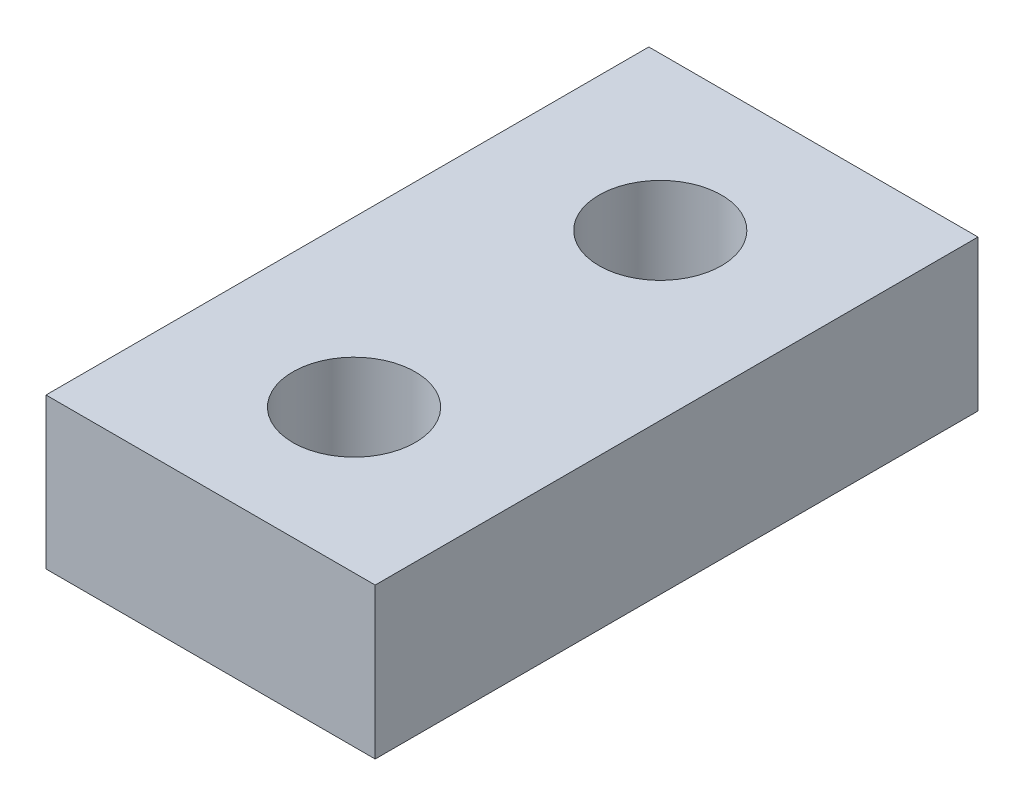
ISO-10303-21;
HEADER;
FILE_DESCRIPTION(('STEP AP214'),'2;1');
FILE_NAME('part.step','',(''),(''),'','','');
FILE_SCHEMA(('AUTOMOTIVE_DESIGN { 1 0 10303 214 1 1 1 1 }'));
ENDSEC;
DATA;
#1=APPLICATION_CONTEXT('core data for automotive mechanical design processes');
#2=APPLICATION_PROTOCOL_DEFINITION('international standard','automotive_design',2000,#1);
#3=PRODUCT_CONTEXT('',#1,'mechanical');
#4=PRODUCT('Part','Part','',(#3));
#5=PRODUCT_RELATED_PRODUCT_CATEGORY('part','',(#4));
#6=PRODUCT_DEFINITION_FORMATION('','',#4);
#7=PRODUCT_DEFINITION_CONTEXT('part definition',#1,'design');
#8=PRODUCT_DEFINITION('design','',#6,#7);
#9=PRODUCT_DEFINITION_SHAPE('','',#8);
#10=(LENGTH_UNIT() NAMED_UNIT(*) SI_UNIT(.MILLI.,.METRE.));
#11=(NAMED_UNIT(*) PLANE_ANGLE_UNIT() SI_UNIT($,.RADIAN.));
#12=(NAMED_UNIT(*) SI_UNIT($,.STERADIAN.) SOLID_ANGLE_UNIT());
#13=UNCERTAINTY_MEASURE_WITH_UNIT(LENGTH_MEASURE(1.E-05),#10,'distance_accuracy_value','');
#14=(GEOMETRIC_REPRESENTATION_CONTEXT(3) GLOBAL_UNCERTAINTY_ASSIGNED_CONTEXT((#13)) GLOBAL_UNIT_ASSIGNED_CONTEXT((#10,
#11,#12)) REPRESENTATION_CONTEXT('',''));
#15=CARTESIAN_POINT('',(0.,0.,0.));
#16=DIRECTION('',(0.,0.,1.));
#17=DIRECTION('',(1.,0.,0.));
#18=AXIS2_PLACEMENT_3D('',#15,#16,#17);
#19=CARTESIAN_POINT('',(0.,5.,0.));
#20=DIRECTION('',(0.,-1.,0.));
#21=DIRECTION('',(0.,0.,-1.));
#22=AXIS2_PLACEMENT_3D('',#19,#20,#21);
#23=PLANE('',#22);
#24=DIRECTION('',(0.,0.,1.));
#25=VECTOR('',#24,1.);
#26=CARTESIAN_POINT('',(0.,5.,0.));
#27=LINE('',#26,#25);
#28=CARTESIAN_POINT('',(0.,5.,-20.));
#29=VERTEX_POINT('',#28);
#30=CARTESIAN_POINT('',(0.,5.,0.));
#31=VERTEX_POINT('',#30);
#32=EDGE_CURVE('E85',#29,#31,#27,.T.);
#33=ORIENTED_EDGE('',*,*,#32,.T.);
#34=DIRECTION('',(1.,0.,0.));
#35=VECTOR('',#34,1.);
#36=CARTESIAN_POINT('',(0.,5.,0.));
#37=LINE('',#36,#35);
#38=CARTESIAN_POINT('',(10.922,5.,0.));
#39=VERTEX_POINT('',#38);
#40=EDGE_CURVE('E80',#31,#39,#37,.T.);
#41=ORIENTED_EDGE('',*,*,#40,.T.);
#42=DIRECTION('',(0.,0.,-1.));
#43=VECTOR('',#42,1.);
#44=CARTESIAN_POINT('',(10.922,5.,0.));
#45=LINE('',#44,#43);
#46=CARTESIAN_POINT('',(10.922,5.,-20.));
#47=VERTEX_POINT('',#46);
#48=EDGE_CURVE('E83',#39,#47,#45,.T.);
#49=ORIENTED_EDGE('',*,*,#48,.T.);
#50=DIRECTION('',(-1.,0.,0.));
#51=VECTOR('',#50,1.);
#52=CARTESIAN_POINT('',(0.,5.,-20.));
#53=LINE('',#52,#51);
#54=EDGE_CURVE('E50',#47,#29,#53,.T.);
#55=ORIENTED_EDGE('',*,*,#54,.T.);
#56=EDGE_LOOP('',(#33,#41,#49,#55));
#57=FACE_BOUND('',#56,.T.);
#58=CARTESIAN_POINT('',(5.461,5.,-14.92));
#59=DIRECTION('',(0.,1.,0.));
#60=DIRECTION('',(0.,0.,1.));
#61=AXIS2_PLACEMENT_3D('',#58,#59,#60);
#62=CIRCLE('',#61,2.032);
#63=CARTESIAN_POINT('',(5.461,5.,-12.888));
#64=VERTEX_POINT('',#63);
#65=EDGE_CURVE('E100',#64,#64,#62,.T.);
#66=ORIENTED_EDGE('',*,*,#65,.F.);
#67=EDGE_LOOP('',(#66));
#68=FACE_BOUND('',#67,.T.);
#69=CARTESIAN_POINT('',(5.461,5.,-4.76));
#70=DIRECTION('',(0.,1.,0.));
#71=DIRECTION('',(0.,0.,1.));
#72=AXIS2_PLACEMENT_3D('',#69,#70,#71);
#73=CIRCLE('',#72,2.032);
#74=CARTESIAN_POINT('',(5.461,5.,-2.728));
#75=VERTEX_POINT('',#74);
#76=EDGE_CURVE('E115',#75,#75,#73,.T.);
#77=ORIENTED_EDGE('',*,*,#76,.F.);
#78=EDGE_LOOP('',(#77));
#79=FACE_BOUND('',#78,.T.);
#80=ADVANCED_FACE('F33',(#57,#68,#79),#23,.F.);
#81=CARTESIAN_POINT('',(0.,0.,0.));
#82=DIRECTION('',(0.,-1.,0.));
#83=DIRECTION('',(0.,0.,-1.));
#84=AXIS2_PLACEMENT_3D('',#81,#82,#83);
#85=PLANE('',#84);
#86=CARTESIAN_POINT('',(5.461,0.,-14.92));
#87=DIRECTION('',(0.,1.,0.));
#88=DIRECTION('',(0.,0.,1.));
#89=AXIS2_PLACEMENT_3D('',#86,#87,#88);
#90=CIRCLE('',#89,2.032);
#91=CARTESIAN_POINT('',(5.461,0.,-12.888));
#92=VERTEX_POINT('',#91);
#93=EDGE_CURVE('E112',#92,#92,#90,.T.);
#94=ORIENTED_EDGE('',*,*,#93,.T.);
#95=EDGE_LOOP('',(#94));
#96=FACE_BOUND('',#95,.T.);
#97=DIRECTION('',(0.,0.,1.));
#98=VECTOR('',#97,1.);
#99=CARTESIAN_POINT('',(0.,0.,0.));
#100=LINE('',#99,#98);
#101=CARTESIAN_POINT('',(0.,0.,-20.));
#102=VERTEX_POINT('',#101);
#103=CARTESIAN_POINT('',(0.,0.,0.));
#104=VERTEX_POINT('',#103);
#105=EDGE_CURVE('E97',#102,#104,#100,.T.);
#106=ORIENTED_EDGE('',*,*,#105,.F.);
#107=DIRECTION('',(-1.,0.,0.));
#108=VECTOR('',#107,1.);
#109=CARTESIAN_POINT('',(0.,0.,-20.));
#110=LINE('',#109,#108);
#111=CARTESIAN_POINT('',(10.922,0.,-20.));
#112=VERTEX_POINT('',#111);
#113=EDGE_CURVE('E73',#112,#102,#110,.T.);
#114=ORIENTED_EDGE('',*,*,#113,.F.);
#115=DIRECTION('',(0.,0.,-1.));
#116=VECTOR('',#115,1.);
#117=CARTESIAN_POINT('',(10.922,0.,0.));
#118=LINE('',#117,#116);
#119=CARTESIAN_POINT('',(10.922,0.,0.));
#120=VERTEX_POINT('',#119);
#121=EDGE_CURVE('E67',#120,#112,#118,.T.);
#122=ORIENTED_EDGE('',*,*,#121,.F.);
#123=DIRECTION('',(1.,0.,0.));
#124=VECTOR('',#123,1.);
#125=CARTESIAN_POINT('',(0.,0.,0.));
#126=LINE('',#125,#124);
#127=EDGE_CURVE('E89',#104,#120,#126,.T.);
#128=ORIENTED_EDGE('',*,*,#127,.F.);
#129=EDGE_LOOP('',(#106,#114,#122,#128));
#130=FACE_BOUND('',#129,.T.);
#131=CARTESIAN_POINT('',(5.461,0.,-4.76));
#132=DIRECTION('',(0.,1.,0.));
#133=DIRECTION('',(0.,0.,1.));
#134=AXIS2_PLACEMENT_3D('',#131,#132,#133);
#135=CIRCLE('',#134,2.032);
#136=CARTESIAN_POINT('',(5.461,0.,-2.728));
#137=VERTEX_POINT('',#136);
#138=EDGE_CURVE('E118',#137,#137,#135,.T.);
#139=ORIENTED_EDGE('',*,*,#138,.T.);
#140=EDGE_LOOP('',(#139));
#141=FACE_BOUND('',#140,.T.);
#142=ADVANCED_FACE('F108',(#96,#130,#141),#85,.T.);
#143=CARTESIAN_POINT('',(0.,5.,0.));
#144=DIRECTION('',(1.,0.,0.));
#145=DIRECTION('',(0.,0.,-1.));
#146=AXIS2_PLACEMENT_3D('',#143,#144,#145);
#147=PLANE('',#146);
#148=ORIENTED_EDGE('',*,*,#105,.T.);
#149=DIRECTION('',(0.,-1.,0.));
#150=VECTOR('',#149,1.);
#151=CARTESIAN_POINT('',(0.,5.,0.));
#152=LINE('',#151,#150);
#153=EDGE_CURVE('E11',#31,#104,#152,.T.);
#154=ORIENTED_EDGE('',*,*,#153,.F.);
#155=ORIENTED_EDGE('',*,*,#32,.F.);
#156=DIRECTION('',(0.,-1.,0.));
#157=VECTOR('',#156,1.);
#158=CARTESIAN_POINT('',(0.,5.,-20.));
#159=LINE('',#158,#157);
#160=EDGE_CURVE('E93',#29,#102,#159,.T.);
#161=ORIENTED_EDGE('',*,*,#160,.T.);
#162=EDGE_LOOP('',(#148,#154,#155,#161));
#163=FACE_BOUND('',#162,.T.);
#164=ADVANCED_FACE('F35',(#163),#147,.F.);
#165=CARTESIAN_POINT('',(0.,5.,0.));
#166=DIRECTION('',(0.,0.,-1.));
#167=DIRECTION('',(-1.,0.,0.));
#168=AXIS2_PLACEMENT_3D('',#165,#166,#167);
#169=PLANE('',#168);
#170=ORIENTED_EDGE('',*,*,#127,.T.);
#171=DIRECTION('',(0.,-1.,0.));
#172=VECTOR('',#171,1.);
#173=CARTESIAN_POINT('',(10.922,5.,0.));
#174=LINE('',#173,#172);
#175=EDGE_CURVE('E42',#39,#120,#174,.T.);
#176=ORIENTED_EDGE('',*,*,#175,.F.);
#177=ORIENTED_EDGE('',*,*,#40,.F.);
#178=ORIENTED_EDGE('',*,*,#153,.T.);
#179=EDGE_LOOP('',(#170,#176,#177,#178));
#180=FACE_BOUND('',#179,.T.);
#181=ADVANCED_FACE('F88',(#180),#169,.F.);
#182=CARTESIAN_POINT('',(10.922,5.,0.));
#183=DIRECTION('',(-1.,0.,0.));
#184=DIRECTION('',(0.,0.,1.));
#185=AXIS2_PLACEMENT_3D('',#182,#183,#184);
#186=PLANE('',#185);
#187=ORIENTED_EDGE('',*,*,#121,.T.);
#188=DIRECTION('',(0.,-1.,0.));
#189=VECTOR('',#188,1.);
#190=CARTESIAN_POINT('',(10.922,5.,-20.));
#191=LINE('',#190,#189);
#192=EDGE_CURVE('E90',#47,#112,#191,.T.);
#193=ORIENTED_EDGE('',*,*,#192,.F.);
#194=ORIENTED_EDGE('',*,*,#48,.F.);
#195=ORIENTED_EDGE('',*,*,#175,.T.);
#196=EDGE_LOOP('',(#187,#193,#194,#195));
#197=FACE_BOUND('',#196,.T.);
#198=ADVANCED_FACE('F91',(#197),#186,.F.);
#199=CARTESIAN_POINT('',(0.,5.,-20.));
#200=DIRECTION('',(0.,0.,1.));
#201=DIRECTION('',(1.,0.,0.));
#202=AXIS2_PLACEMENT_3D('',#199,#200,#201);
#203=PLANE('',#202);
#204=ORIENTED_EDGE('',*,*,#113,.T.);
#205=ORIENTED_EDGE('',*,*,#160,.F.);
#206=ORIENTED_EDGE('',*,*,#54,.F.);
#207=ORIENTED_EDGE('',*,*,#192,.T.);
#208=EDGE_LOOP('',(#204,#205,#206,#207));
#209=FACE_BOUND('',#208,.T.);
#210=ADVANCED_FACE('F105',(#209),#203,.F.);
#211=CARTESIAN_POINT('',(5.461,5.,-14.92));
#212=DIRECTION('',(0.,-1.,0.));
#213=DIRECTION('',(0.,0.,-1.));
#214=AXIS2_PLACEMENT_3D('',#211,#212,#213);
#215=CYLINDRICAL_SURFACE('',#214,2.032);
#216=ORIENTED_EDGE('',*,*,#65,.T.);
#217=EDGE_LOOP('',(#216));
#218=FACE_BOUND('',#217,.T.);
#219=ORIENTED_EDGE('',*,*,#93,.F.);
#220=EDGE_LOOP('',(#219));
#221=FACE_BOUND('',#220,.T.);
#222=ADVANCED_FACE('F135',(#218,#221),#215,.F.);
#223=CARTESIAN_POINT('',(5.461,5.,-4.76));
#224=DIRECTION('',(0.,-1.,0.));
#225=DIRECTION('',(0.,0.,-1.));
#226=AXIS2_PLACEMENT_3D('',#223,#224,#225);
#227=CYLINDRICAL_SURFACE('',#226,2.032);
#228=ORIENTED_EDGE('',*,*,#76,.T.);
#229=EDGE_LOOP('',(#228));
#230=FACE_BOUND('',#229,.T.);
#231=ORIENTED_EDGE('',*,*,#138,.F.);
#232=EDGE_LOOP('',(#231));
#233=FACE_BOUND('',#232,.T.);
#234=ADVANCED_FACE('F124',(#230,#233),#227,.F.);
#235=CLOSED_SHELL('',(#80,#142,#164,#181,#198,#210,#222,#234));
#236=MANIFOLD_SOLID_BREP('B2',#235);
#237=ADVANCED_BREP_SHAPE_REPRESENTATION('',(#18,#236),#14);
#238=SHAPE_DEFINITION_REPRESENTATION(#9,#237);
ENDSEC;
END-ISO-10303-21;
